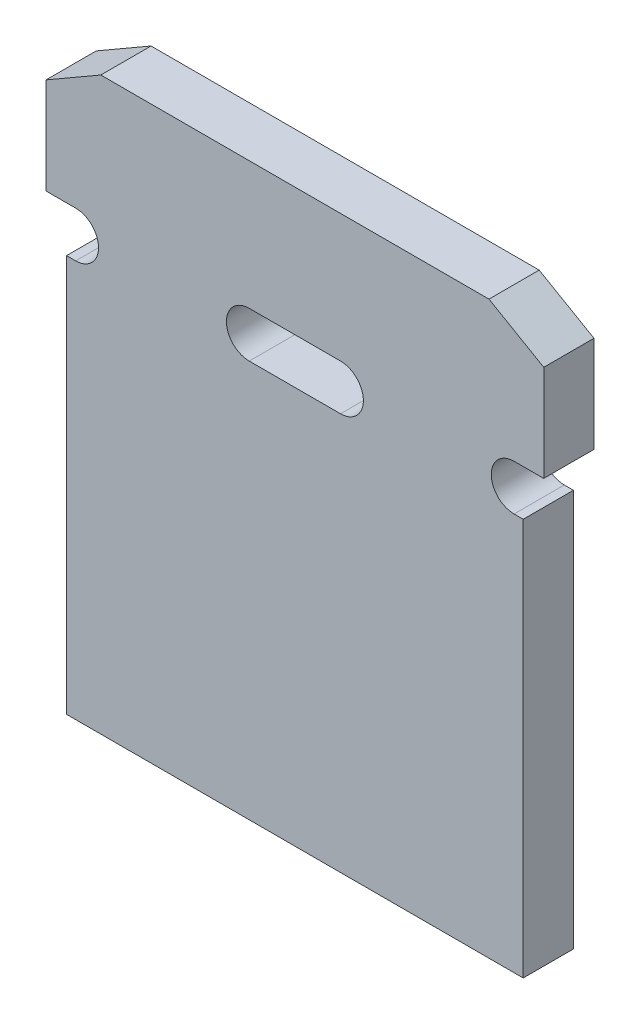
ISO-10303-21;
HEADER;
FILE_DESCRIPTION(('STEP AP214'),'2;1');
FILE_NAME('part.step','',(''),(''),'','','');
FILE_SCHEMA(('AUTOMOTIVE_DESIGN { 1 0 10303 214 1 1 1 1 }'));
ENDSEC;
DATA;
#1=APPLICATION_CONTEXT('core data for automotive mechanical design processes');
#2=APPLICATION_PROTOCOL_DEFINITION('international standard','automotive_design',2000,#1);
#3=PRODUCT_CONTEXT('',#1,'mechanical');
#4=PRODUCT('Part','Part','',(#3));
#5=PRODUCT_RELATED_PRODUCT_CATEGORY('part','',(#4));
#6=PRODUCT_DEFINITION_FORMATION('','',#4);
#7=PRODUCT_DEFINITION_CONTEXT('part definition',#1,'design');
#8=PRODUCT_DEFINITION('design','',#6,#7);
#9=PRODUCT_DEFINITION_SHAPE('','',#8);
#10=(LENGTH_UNIT() NAMED_UNIT(*) SI_UNIT(.MILLI.,.METRE.));
#11=(NAMED_UNIT(*) PLANE_ANGLE_UNIT() SI_UNIT($,.RADIAN.));
#12=(NAMED_UNIT(*) SI_UNIT($,.STERADIAN.) SOLID_ANGLE_UNIT());
#13=UNCERTAINTY_MEASURE_WITH_UNIT(LENGTH_MEASURE(1.E-05),#10,'distance_accuracy_value','');
#14=(GEOMETRIC_REPRESENTATION_CONTEXT(3) GLOBAL_UNCERTAINTY_ASSIGNED_CONTEXT((#13)) GLOBAL_UNIT_ASSIGNED_CONTEXT((#10,
#11,#12)) REPRESENTATION_CONTEXT('',''));
#15=CARTESIAN_POINT('',(0.,0.,0.));
#16=DIRECTION('',(0.,0.,1.));
#17=DIRECTION('',(1.,0.,0.));
#18=AXIS2_PLACEMENT_3D('',#15,#16,#17);
#19=CARTESIAN_POINT('',(0.,0.,0.));
#20=DIRECTION('',(0.,0.,1.));
#21=DIRECTION('',(0.707106781186548,0.707106781186548,0.));
#22=AXIS2_PLACEMENT_3D('',#19,#20,#21);
#23=PLANE('',#22);
#24=CARTESIAN_POINT('',(-0.109999999998502,7.75000000000292,0.));
#25=DIRECTION('',(0.,0.,-1.));
#26=DIRECTION('',(0.,1.,0.));
#27=AXIS2_PLACEMENT_3D('',#24,#25,#26);
#28=CIRCLE('',#27,0.25);
#29=CARTESIAN_POINT('',(-0.109999999998502,8.00000000000292,0.));
#30=VERTEX_POINT('',#29);
#31=CARTESIAN_POINT('',(-0.109999999998502,7.50000000000292,0.));
#32=VERTEX_POINT('',#31);
#33=EDGE_CURVE('E174',#30,#32,#28,.T.);
#34=ORIENTED_EDGE('',*,*,#33,.F.);
#35=DIRECTION('',(1.,0.,0.));
#36=VECTOR('',#35,1.);
#37=CARTESIAN_POINT('',(-0.434999999998499,8.00000000000292,0.));
#38=LINE('',#37,#36);
#39=CARTESIAN_POINT('',(-0.434999999998499,8.00000000000292,0.));
#40=VERTEX_POINT('',#39);
#41=EDGE_CURVE('E35',#40,#30,#38,.T.);
#42=ORIENTED_EDGE('',*,*,#41,.F.);
#43=DIRECTION('',(0.,-1.,0.));
#44=VECTOR('',#43,1.);
#45=CARTESIAN_POINT('',(-0.434999999998499,9.05358983848914,0.));
#46=LINE('',#45,#44);
#47=CARTESIAN_POINT('',(-0.434999999998499,9.05358983848914,0.));
#48=VERTEX_POINT('',#47);
#49=EDGE_CURVE('E177',#48,#40,#46,.T.);
#50=ORIENTED_EDGE('',*,*,#49,.F.);
#51=DIRECTION('',(-0.866025403784437,-0.5,0.));
#52=VECTOR('',#51,1.);
#53=CARTESIAN_POINT('',(0.165000000001502,9.40000000000292,0.));
#54=LINE('',#53,#52);
#55=CARTESIAN_POINT('',(0.165000000001502,9.40000000000292,0.));
#56=VERTEX_POINT('',#55);
#57=EDGE_CURVE('E181',#56,#48,#54,.T.);
#58=ORIENTED_EDGE('',*,*,#57,.F.);
#59=DIRECTION('',(-1.,0.,0.));
#60=VECTOR('',#59,1.);
#61=CARTESIAN_POINT('',(4.4150000000015,9.40000000000292,0.));
#62=LINE('',#61,#60);
#63=CARTESIAN_POINT('',(4.4150000000015,9.40000000000292,0.));
#64=VERTEX_POINT('',#63);
#65=EDGE_CURVE('E185',#64,#56,#62,.T.);
#66=ORIENTED_EDGE('',*,*,#65,.F.);
#67=DIRECTION('',(-0.866025403784437,0.5,0.));
#68=VECTOR('',#67,1.);
#69=CARTESIAN_POINT('',(5.0150000000015,9.05358983848914,0.));
#70=LINE('',#69,#68);
#71=CARTESIAN_POINT('',(5.0150000000015,9.05358983848914,0.));
#72=VERTEX_POINT('',#71);
#73=EDGE_CURVE('E189',#72,#64,#70,.T.);
#74=ORIENTED_EDGE('',*,*,#73,.F.);
#75=DIRECTION('',(0.,1.,0.));
#76=VECTOR('',#75,1.);
#77=CARTESIAN_POINT('',(5.0150000000015,8.00000000000292,0.));
#78=LINE('',#77,#76);
#79=CARTESIAN_POINT('',(5.0150000000015,8.00000000000292,0.));
#80=VERTEX_POINT('',#79);
#81=EDGE_CURVE('E193',#80,#72,#78,.T.);
#82=ORIENTED_EDGE('',*,*,#81,.F.);
#83=DIRECTION('',(1.,0.,0.));
#84=VECTOR('',#83,1.);
#85=CARTESIAN_POINT('',(4.6900000000015,8.00000000000292,0.));
#86=LINE('',#85,#84);
#87=CARTESIAN_POINT('',(4.6900000000015,8.00000000000292,0.));
#88=VERTEX_POINT('',#87);
#89=EDGE_CURVE('E197',#88,#80,#86,.T.);
#90=ORIENTED_EDGE('',*,*,#89,.F.);
#91=CARTESIAN_POINT('',(4.6900000000015,7.75000000000292,0.));
#92=DIRECTION('',(0.,0.,-1.));
#93=DIRECTION('',(0.,-1.,0.));
#94=AXIS2_PLACEMENT_3D('',#91,#92,#93);
#95=CIRCLE('',#94,0.25);
#96=CARTESIAN_POINT('',(4.6900000000015,7.50000000000292,0.));
#97=VERTEX_POINT('',#96);
#98=EDGE_CURVE('E201',#97,#88,#95,.T.);
#99=ORIENTED_EDGE('',*,*,#98,.F.);
#100=DIRECTION('',(-1.,0.,0.));
#101=VECTOR('',#100,1.);
#102=CARTESIAN_POINT('',(4.79000000000131,7.50000000000292,0.));
#103=LINE('',#102,#101);
#104=CARTESIAN_POINT('',(4.79000000000131,7.50000000000292,0.));
#105=VERTEX_POINT('',#104);
#106=EDGE_CURVE('E205',#105,#97,#103,.T.);
#107=ORIENTED_EDGE('',*,*,#106,.F.);
#108=DIRECTION('',(0.,1.,0.));
#109=VECTOR('',#108,1.);
#110=CARTESIAN_POINT('',(4.79000000000131,3.15000000000292,0.));
#111=LINE('',#110,#109);
#112=CARTESIAN_POINT('',(4.79000000000131,3.15000000000292,0.));
#113=VERTEX_POINT('',#112);
#114=EDGE_CURVE('E209',#113,#105,#111,.T.);
#115=ORIENTED_EDGE('',*,*,#114,.F.);
#116=DIRECTION('',(1.,0.,0.));
#117=VECTOR('',#116,1.);
#118=CARTESIAN_POINT('',(-0.209999999998307,3.15000000000292,0.));
#119=LINE('',#118,#117);
#120=CARTESIAN_POINT('',(-0.209999999998307,3.15000000000292,0.));
#121=VERTEX_POINT('',#120);
#122=EDGE_CURVE('E213',#121,#113,#119,.T.);
#123=ORIENTED_EDGE('',*,*,#122,.F.);
#124=DIRECTION('',(0.,-1.,0.));
#125=VECTOR('',#124,1.);
#126=CARTESIAN_POINT('',(-0.209999999998306,7.50000000000292,0.));
#127=LINE('',#126,#125);
#128=CARTESIAN_POINT('',(-0.209999999998306,7.50000000000292,0.));
#129=VERTEX_POINT('',#128);
#130=EDGE_CURVE('E216',#129,#121,#127,.T.);
#131=ORIENTED_EDGE('',*,*,#130,.F.);
#132=DIRECTION('',(-1.,0.,0.));
#133=VECTOR('',#132,1.);
#134=CARTESIAN_POINT('',(-0.109999999998502,7.50000000000292,0.));
#135=LINE('',#134,#133);
#136=EDGE_CURVE('E219',#32,#129,#135,.T.);
#137=ORIENTED_EDGE('',*,*,#136,.F.);
#138=EDGE_LOOP('',(#34,#42,#50,#58,#66,#74,#82,#90,#99,#107,#115,#123,#131,#137));
#139=FACE_BOUND('',#138,.T.);
#140=DIRECTION('',(1.,0.,0.));
#141=VECTOR('',#140,1.);
#142=CARTESIAN_POINT('',(1.7900000000015,7.50000000000292,0.));
#143=LINE('',#142,#141);
#144=CARTESIAN_POINT('',(1.7900000000015,7.50000000000292,0.));
#145=VERTEX_POINT('',#144);
#146=CARTESIAN_POINT('',(2.7900000000015,7.50000000000292,0.));
#147=VERTEX_POINT('',#146);
#148=EDGE_CURVE('E11',#145,#147,#143,.T.);
#149=ORIENTED_EDGE('',*,*,#148,.T.);
#150=CARTESIAN_POINT('',(2.7900000000015,7.75000000000292,0.));
#151=DIRECTION('',(0.,0.,1.));
#152=DIRECTION('',(0.,-1.,0.));
#153=AXIS2_PLACEMENT_3D('',#150,#151,#152);
#154=CIRCLE('',#153,0.25);
#155=CARTESIAN_POINT('',(2.7900000000015,8.00000000000292,0.));
#156=VERTEX_POINT('',#155);
#157=EDGE_CURVE('E26',#147,#156,#154,.T.);
#158=ORIENTED_EDGE('',*,*,#157,.T.);
#159=DIRECTION('',(-1.,0.,0.));
#160=VECTOR('',#159,1.);
#161=CARTESIAN_POINT('',(2.7900000000015,8.00000000000292,0.));
#162=LINE('',#161,#160);
#163=CARTESIAN_POINT('',(1.7900000000015,8.00000000000292,0.));
#164=VERTEX_POINT('',#163);
#165=EDGE_CURVE('E163',#156,#164,#162,.T.);
#166=ORIENTED_EDGE('',*,*,#165,.T.);
#167=CARTESIAN_POINT('',(1.7900000000015,7.75000000000292,0.));
#168=DIRECTION('',(0.,0.,1.));
#169=DIRECTION('',(0.,1.,0.));
#170=AXIS2_PLACEMENT_3D('',#167,#168,#169);
#171=CIRCLE('',#170,0.25);
#172=EDGE_CURVE('E232',#164,#145,#171,.T.);
#173=ORIENTED_EDGE('',*,*,#172,.T.);
#174=EDGE_LOOP('',(#149,#158,#166,#173));
#175=FACE_BOUND('',#174,.T.);
#176=ADVANCED_FACE('F16',(#139,#175),#23,.F.);
#177=CARTESIAN_POINT('',(0.,0.,0.55));
#178=DIRECTION('',(0.,0.,1.));
#179=DIRECTION('',(0.707106781186548,0.707106781186548,0.));
#180=AXIS2_PLACEMENT_3D('',#177,#178,#179);
#181=PLANE('',#180);
#182=DIRECTION('',(-1.,0.,0.));
#183=VECTOR('',#182,1.);
#184=CARTESIAN_POINT('',(-0.109999999998502,7.50000000000292,0.55));
#185=LINE('',#184,#183);
#186=CARTESIAN_POINT('',(-0.109999999998502,7.50000000000292,0.55));
#187=VERTEX_POINT('',#186);
#188=CARTESIAN_POINT('',(-0.209999999998306,7.50000000000292,0.55));
#189=VERTEX_POINT('',#188);
#190=EDGE_CURVE('E234',#187,#189,#185,.T.);
#191=ORIENTED_EDGE('',*,*,#190,.T.);
#192=DIRECTION('',(0.,-1.,0.));
#193=VECTOR('',#192,1.);
#194=CARTESIAN_POINT('',(-0.209999999998306,7.50000000000292,0.55));
#195=LINE('',#194,#193);
#196=CARTESIAN_POINT('',(-0.209999999998307,3.15000000000292,0.55));
#197=VERTEX_POINT('',#196);
#198=EDGE_CURVE('E237',#189,#197,#195,.T.);
#199=ORIENTED_EDGE('',*,*,#198,.T.);
#200=DIRECTION('',(1.,0.,0.));
#201=VECTOR('',#200,1.);
#202=CARTESIAN_POINT('',(-0.209999999998307,3.15000000000292,0.55));
#203=LINE('',#202,#201);
#204=CARTESIAN_POINT('',(4.79000000000131,3.15000000000292,0.55));
#205=VERTEX_POINT('',#204);
#206=EDGE_CURVE('E240',#197,#205,#203,.T.);
#207=ORIENTED_EDGE('',*,*,#206,.T.);
#208=DIRECTION('',(0.,1.,0.));
#209=VECTOR('',#208,1.);
#210=CARTESIAN_POINT('',(4.79000000000131,3.15000000000292,0.55));
#211=LINE('',#210,#209);
#212=CARTESIAN_POINT('',(4.79000000000131,7.50000000000292,0.55));
#213=VERTEX_POINT('',#212);
#214=EDGE_CURVE('E243',#205,#213,#211,.T.);
#215=ORIENTED_EDGE('',*,*,#214,.T.);
#216=DIRECTION('',(-1.,0.,0.));
#217=VECTOR('',#216,1.);
#218=CARTESIAN_POINT('',(4.79000000000131,7.50000000000292,0.55));
#219=LINE('',#218,#217);
#220=CARTESIAN_POINT('',(4.6900000000015,7.50000000000292,0.55));
#221=VERTEX_POINT('',#220);
#222=EDGE_CURVE('E246',#213,#221,#219,.T.);
#223=ORIENTED_EDGE('',*,*,#222,.T.);
#224=CARTESIAN_POINT('',(4.6900000000015,7.75000000000292,0.55));
#225=DIRECTION('',(0.,0.,-1.));
#226=DIRECTION('',(0.,-1.,0.));
#227=AXIS2_PLACEMENT_3D('',#224,#225,#226);
#228=CIRCLE('',#227,0.25);
#229=CARTESIAN_POINT('',(4.6900000000015,8.00000000000292,0.55));
#230=VERTEX_POINT('',#229);
#231=EDGE_CURVE('E249',#221,#230,#228,.T.);
#232=ORIENTED_EDGE('',*,*,#231,.T.);
#233=DIRECTION('',(1.,0.,0.));
#234=VECTOR('',#233,1.);
#235=CARTESIAN_POINT('',(4.6900000000015,8.00000000000292,0.55));
#236=LINE('',#235,#234);
#237=CARTESIAN_POINT('',(5.0150000000015,8.00000000000292,0.55));
#238=VERTEX_POINT('',#237);
#239=EDGE_CURVE('E252',#230,#238,#236,.T.);
#240=ORIENTED_EDGE('',*,*,#239,.T.);
#241=DIRECTION('',(0.,1.,0.));
#242=VECTOR('',#241,1.);
#243=CARTESIAN_POINT('',(5.0150000000015,8.00000000000292,0.55));
#244=LINE('',#243,#242);
#245=CARTESIAN_POINT('',(5.0150000000015,9.05358983848914,0.55));
#246=VERTEX_POINT('',#245);
#247=EDGE_CURVE('E255',#238,#246,#244,.T.);
#248=ORIENTED_EDGE('',*,*,#247,.T.);
#249=DIRECTION('',(-0.866025403784437,0.5,0.));
#250=VECTOR('',#249,1.);
#251=CARTESIAN_POINT('',(5.0150000000015,9.05358983848914,0.55));
#252=LINE('',#251,#250);
#253=CARTESIAN_POINT('',(4.4150000000015,9.40000000000292,0.55));
#254=VERTEX_POINT('',#253);
#255=EDGE_CURVE('E258',#246,#254,#252,.T.);
#256=ORIENTED_EDGE('',*,*,#255,.T.);
#257=DIRECTION('',(-1.,0.,0.));
#258=VECTOR('',#257,1.);
#259=CARTESIAN_POINT('',(4.4150000000015,9.40000000000292,0.55));
#260=LINE('',#259,#258);
#261=CARTESIAN_POINT('',(0.165000000001502,9.40000000000292,0.55));
#262=VERTEX_POINT('',#261);
#263=EDGE_CURVE('E261',#254,#262,#260,.T.);
#264=ORIENTED_EDGE('',*,*,#263,.T.);
#265=DIRECTION('',(-0.866025403784437,-0.5,0.));
#266=VECTOR('',#265,1.);
#267=CARTESIAN_POINT('',(0.165000000001502,9.40000000000292,0.55));
#268=LINE('',#267,#266);
#269=CARTESIAN_POINT('',(-0.434999999998499,9.05358983848914,0.55));
#270=VERTEX_POINT('',#269);
#271=EDGE_CURVE('E264',#262,#270,#268,.T.);
#272=ORIENTED_EDGE('',*,*,#271,.T.);
#273=DIRECTION('',(0.,-1.,0.));
#274=VECTOR('',#273,1.);
#275=CARTESIAN_POINT('',(-0.434999999998499,9.05358983848914,0.55));
#276=LINE('',#275,#274);
#277=CARTESIAN_POINT('',(-0.434999999998499,8.00000000000292,0.55));
#278=VERTEX_POINT('',#277);
#279=EDGE_CURVE('E267',#270,#278,#276,.T.);
#280=ORIENTED_EDGE('',*,*,#279,.T.);
#281=DIRECTION('',(1.,0.,0.));
#282=VECTOR('',#281,1.);
#283=CARTESIAN_POINT('',(-0.434999999998499,8.00000000000292,0.55));
#284=LINE('',#283,#282);
#285=CARTESIAN_POINT('',(-0.109999999998502,8.00000000000292,0.55));
#286=VERTEX_POINT('',#285);
#287=EDGE_CURVE('E270',#278,#286,#284,.T.);
#288=ORIENTED_EDGE('',*,*,#287,.T.);
#289=CARTESIAN_POINT('',(-0.109999999998502,7.75000000000292,0.55));
#290=DIRECTION('',(0.,0.,-1.));
#291=DIRECTION('',(0.,1.,0.));
#292=AXIS2_PLACEMENT_3D('',#289,#290,#291);
#293=CIRCLE('',#292,0.25);
#294=EDGE_CURVE('E273',#286,#187,#293,.T.);
#295=ORIENTED_EDGE('',*,*,#294,.T.);
#296=EDGE_LOOP('',(#191,#199,#207,#215,#223,#232,#240,#248,#256,#264,#272,#280,#288,#295));
#297=FACE_BOUND('',#296,.T.);
#298=DIRECTION('',(-1.,0.,0.));
#299=VECTOR('',#298,1.);
#300=CARTESIAN_POINT('',(1.7900000000015,7.50000000000292,0.55));
#301=LINE('',#300,#299);
#302=CARTESIAN_POINT('',(2.7900000000015,7.50000000000292,0.55));
#303=VERTEX_POINT('',#302);
#304=CARTESIAN_POINT('',(1.7900000000015,7.50000000000292,0.55));
#305=VERTEX_POINT('',#304);
#306=EDGE_CURVE('E275',#303,#305,#301,.T.);
#307=ORIENTED_EDGE('',*,*,#306,.T.);
#308=CARTESIAN_POINT('',(1.7900000000015,7.75000000000292,0.55));
#309=DIRECTION('',(0.,0.,-1.));
#310=DIRECTION('',(0.,1.,0.));
#311=AXIS2_PLACEMENT_3D('',#308,#309,#310);
#312=CIRCLE('',#311,0.25);
#313=CARTESIAN_POINT('',(1.7900000000015,8.00000000000292,0.55));
#314=VERTEX_POINT('',#313);
#315=EDGE_CURVE('E158',#305,#314,#312,.T.);
#316=ORIENTED_EDGE('',*,*,#315,.T.);
#317=DIRECTION('',(1.,0.,0.));
#318=VECTOR('',#317,1.);
#319=CARTESIAN_POINT('',(2.7900000000015,8.00000000000292,0.55));
#320=LINE('',#319,#318);
#321=CARTESIAN_POINT('',(2.7900000000015,8.00000000000292,0.55));
#322=VERTEX_POINT('',#321);
#323=EDGE_CURVE('E141',#314,#322,#320,.T.);
#324=ORIENTED_EDGE('',*,*,#323,.T.);
#325=CARTESIAN_POINT('',(2.7900000000015,7.75000000000292,0.55));
#326=DIRECTION('',(0.,0.,-1.));
#327=DIRECTION('',(0.,-1.,0.));
#328=AXIS2_PLACEMENT_3D('',#325,#326,#327);
#329=CIRCLE('',#328,0.25);
#330=EDGE_CURVE('E147',#322,#303,#329,.T.);
#331=ORIENTED_EDGE('',*,*,#330,.T.);
#332=EDGE_LOOP('',(#307,#316,#324,#331));
#333=FACE_BOUND('',#332,.T.);
#334=ADVANCED_FACE('F157',(#297,#333),#181,.T.);
#335=CARTESIAN_POINT('',(1.7900000000015,7.75000000000292,0.));
#336=DIRECTION('',(0.,0.,1.));
#337=DIRECTION('',(0.,1.,0.));
#338=AXIS2_PLACEMENT_3D('',#335,#336,#337);
#339=CYLINDRICAL_SURFACE('',#338,0.25);
#340=ORIENTED_EDGE('',*,*,#315,.F.);
#341=DIRECTION('',(0.,0.,1.));
#342=VECTOR('',#341,1.);
#343=CARTESIAN_POINT('',(1.7900000000015,7.50000000000292,0.));
#344=LINE('',#343,#342);
#345=EDGE_CURVE('E167',#145,#305,#344,.T.);
#346=ORIENTED_EDGE('',*,*,#345,.F.);
#347=ORIENTED_EDGE('',*,*,#172,.F.);
#348=DIRECTION('',(0.,0.,1.));
#349=VECTOR('',#348,1.);
#350=CARTESIAN_POINT('',(1.7900000000015,8.00000000000292,0.));
#351=LINE('',#350,#349);
#352=EDGE_CURVE('E155',#164,#314,#351,.T.);
#353=ORIENTED_EDGE('',*,*,#352,.T.);
#354=EDGE_LOOP('',(#340,#346,#347,#353));
#355=FACE_BOUND('',#354,.T.);
#356=ADVANCED_FACE('F331',(#355),#339,.F.);
#357=CARTESIAN_POINT('',(2.7900000000015,8.00000000000292,0.));
#358=DIRECTION('',(0.,1.,0.));
#359=DIRECTION('',(0.707106781186548,0.,0.707106781186548));
#360=AXIS2_PLACEMENT_3D('',#357,#358,#359);
#361=PLANE('',#360);
#362=ORIENTED_EDGE('',*,*,#323,.F.);
#363=ORIENTED_EDGE('',*,*,#352,.F.);
#364=ORIENTED_EDGE('',*,*,#165,.F.);
#365=DIRECTION('',(0.,0.,1.));
#366=VECTOR('',#365,1.);
#367=CARTESIAN_POINT('',(2.7900000000015,8.00000000000292,0.));
#368=LINE('',#367,#366);
#369=EDGE_CURVE('E149',#156,#322,#368,.T.);
#370=ORIENTED_EDGE('',*,*,#369,.T.);
#371=EDGE_LOOP('',(#362,#363,#364,#370));
#372=FACE_BOUND('',#371,.T.);
#373=ADVANCED_FACE('F161',(#372),#361,.F.);
#374=CARTESIAN_POINT('',(2.7900000000015,7.75000000000292,0.));
#375=DIRECTION('',(0.,0.,1.));
#376=DIRECTION('',(0.,-1.,0.));
#377=AXIS2_PLACEMENT_3D('',#374,#375,#376);
#378=CYLINDRICAL_SURFACE('',#377,0.25);
#379=ORIENTED_EDGE('',*,*,#330,.F.);
#380=ORIENTED_EDGE('',*,*,#369,.F.);
#381=ORIENTED_EDGE('',*,*,#157,.F.);
#382=DIRECTION('',(0.,0.,1.));
#383=VECTOR('',#382,1.);
#384=CARTESIAN_POINT('',(2.7900000000015,7.50000000000292,0.));
#385=LINE('',#384,#383);
#386=EDGE_CURVE('E151',#147,#303,#385,.T.);
#387=ORIENTED_EDGE('',*,*,#386,.T.);
#388=EDGE_LOOP('',(#379,#380,#381,#387));
#389=FACE_BOUND('',#388,.T.);
#390=ADVANCED_FACE('F148',(#389),#378,.F.);
#391=CARTESIAN_POINT('',(1.7900000000015,7.50000000000292,0.));
#392=DIRECTION('',(0.,-1.,0.));
#393=DIRECTION('',(0.707106781186548,0.,0.707106781186548));
#394=AXIS2_PLACEMENT_3D('',#391,#392,#393);
#395=PLANE('',#394);
#396=ORIENTED_EDGE('',*,*,#306,.F.);
#397=ORIENTED_EDGE('',*,*,#386,.F.);
#398=ORIENTED_EDGE('',*,*,#148,.F.);
#399=ORIENTED_EDGE('',*,*,#345,.T.);
#400=EDGE_LOOP('',(#396,#397,#398,#399));
#401=FACE_BOUND('',#400,.T.);
#402=ADVANCED_FACE('F324',(#401),#395,.F.);
#403=CARTESIAN_POINT('',(-0.109999999998502,7.75000000000292,0.));
#404=DIRECTION('',(0.,0.,-1.));
#405=DIRECTION('',(0.,1.,0.));
#406=AXIS2_PLACEMENT_3D('',#403,#404,#405);
#407=CYLINDRICAL_SURFACE('',#406,0.25);
#408=ORIENTED_EDGE('',*,*,#33,.T.);
#409=DIRECTION('',(0.,0.,1.));
#410=VECTOR('',#409,1.);
#411=CARTESIAN_POINT('',(-0.109999999998502,7.50000000000292,0.));
#412=LINE('',#411,#410);
#413=EDGE_CURVE('E171',#32,#187,#412,.T.);
#414=ORIENTED_EDGE('',*,*,#413,.T.);
#415=ORIENTED_EDGE('',*,*,#294,.F.);
#416=DIRECTION('',(0.,0.,1.));
#417=VECTOR('',#416,1.);
#418=CARTESIAN_POINT('',(-0.109999999998502,8.00000000000292,0.));
#419=LINE('',#418,#417);
#420=EDGE_CURVE('E175',#30,#286,#419,.T.);
#421=ORIENTED_EDGE('',*,*,#420,.F.);
#422=EDGE_LOOP('',(#408,#414,#415,#421));
#423=FACE_BOUND('',#422,.T.);
#424=ADVANCED_FACE('F311',(#423),#407,.F.);
#425=CARTESIAN_POINT('',(-0.434999999998499,8.00000000000292,0.));
#426=DIRECTION('',(0.,-1.,0.));
#427=DIRECTION('',(0.707106781186548,0.,0.707106781186548));
#428=AXIS2_PLACEMENT_3D('',#425,#426,#427);
#429=PLANE('',#428);
#430=ORIENTED_EDGE('',*,*,#41,.T.);
#431=ORIENTED_EDGE('',*,*,#420,.T.);
#432=ORIENTED_EDGE('',*,*,#287,.F.);
#433=DIRECTION('',(0.,0.,1.));
#434=VECTOR('',#433,1.);
#435=CARTESIAN_POINT('',(-0.434999999998499,8.00000000000292,0.));
#436=LINE('',#435,#434);
#437=EDGE_CURVE('E178',#40,#278,#436,.T.);
#438=ORIENTED_EDGE('',*,*,#437,.F.);
#439=EDGE_LOOP('',(#430,#431,#432,#438));
#440=FACE_BOUND('',#439,.T.);
#441=ADVANCED_FACE('F312',(#440),#429,.T.);
#442=CARTESIAN_POINT('',(-0.434999999998499,9.05358983848914,0.));
#443=DIRECTION('',(-1.,0.,0.));
#444=DIRECTION('',(0.,0.707106781186548,0.707106781186548));
#445=AXIS2_PLACEMENT_3D('',#442,#443,#444);
#446=PLANE('',#445);
#447=ORIENTED_EDGE('',*,*,#49,.T.);
#448=ORIENTED_EDGE('',*,*,#437,.T.);
#449=ORIENTED_EDGE('',*,*,#279,.F.);
#450=DIRECTION('',(0.,0.,1.));
#451=VECTOR('',#450,1.);
#452=CARTESIAN_POINT('',(-0.434999999998499,9.05358983848914,0.));
#453=LINE('',#452,#451);
#454=EDGE_CURVE('E182',#48,#270,#453,.T.);
#455=ORIENTED_EDGE('',*,*,#454,.F.);
#456=EDGE_LOOP('',(#447,#448,#449,#455));
#457=FACE_BOUND('',#456,.T.);
#458=ADVANCED_FACE('F314',(#457),#446,.T.);
#459=CARTESIAN_POINT('',(0.165000000001502,9.40000000000292,0.));
#460=DIRECTION('',(-0.5,0.866025403784437,0.));
#461=DIRECTION('',(0.774596669241481,0.44721359549996,0.44721359549996));
#462=AXIS2_PLACEMENT_3D('',#459,#460,#461);
#463=PLANE('',#462);
#464=ORIENTED_EDGE('',*,*,#57,.T.);
#465=ORIENTED_EDGE('',*,*,#454,.T.);
#466=ORIENTED_EDGE('',*,*,#271,.F.);
#467=DIRECTION('',(0.,0.,1.));
#468=VECTOR('',#467,1.);
#469=CARTESIAN_POINT('',(0.165000000001502,9.40000000000292,0.));
#470=LINE('',#469,#468);
#471=EDGE_CURVE('E186',#56,#262,#470,.T.);
#472=ORIENTED_EDGE('',*,*,#471,.F.);
#473=EDGE_LOOP('',(#464,#465,#466,#472));
#474=FACE_BOUND('',#473,.T.);
#475=ADVANCED_FACE('F321',(#474),#463,.T.);
#476=CARTESIAN_POINT('',(4.4150000000015,9.40000000000292,0.));
#477=DIRECTION('',(0.,1.,0.));
#478=DIRECTION('',(0.707106781186548,0.,0.707106781186548));
#479=AXIS2_PLACEMENT_3D('',#476,#477,#478);
#480=PLANE('',#479);
#481=ORIENTED_EDGE('',*,*,#65,.T.);
#482=ORIENTED_EDGE('',*,*,#471,.T.);
#483=ORIENTED_EDGE('',*,*,#263,.F.);
#484=DIRECTION('',(0.,0.,1.));
#485=VECTOR('',#484,1.);
#486=CARTESIAN_POINT('',(4.4150000000015,9.40000000000292,0.));
#487=LINE('',#486,#485);
#488=EDGE_CURVE('E190',#64,#254,#487,.T.);
#489=ORIENTED_EDGE('',*,*,#488,.F.);
#490=EDGE_LOOP('',(#481,#482,#483,#489));
#491=FACE_BOUND('',#490,.T.);
#492=ADVANCED_FACE('F380',(#491),#480,.T.);
#493=CARTESIAN_POINT('',(5.0150000000015,9.05358983848914,0.));
#494=DIRECTION('',(0.5,0.866025403784437,0.));
#495=DIRECTION('',(-0.774596669241481,0.44721359549996,0.44721359549996));
#496=AXIS2_PLACEMENT_3D('',#493,#494,#495);
#497=PLANE('',#496);
#498=ORIENTED_EDGE('',*,*,#73,.T.);
#499=ORIENTED_EDGE('',*,*,#488,.T.);
#500=ORIENTED_EDGE('',*,*,#255,.F.);
#501=DIRECTION('',(0.,0.,1.));
#502=VECTOR('',#501,1.);
#503=CARTESIAN_POINT('',(5.0150000000015,9.05358983848914,0.));
#504=LINE('',#503,#502);
#505=EDGE_CURVE('E194',#72,#246,#504,.T.);
#506=ORIENTED_EDGE('',*,*,#505,.F.);
#507=EDGE_LOOP('',(#498,#499,#500,#506));
#508=FACE_BOUND('',#507,.T.);
#509=ADVANCED_FACE('F391',(#508),#497,.T.);
#510=CARTESIAN_POINT('',(5.0150000000015,8.00000000000292,0.));
#511=DIRECTION('',(1.,0.,0.));
#512=DIRECTION('',(0.,0.707106781186548,0.707106781186548));
#513=AXIS2_PLACEMENT_3D('',#510,#511,#512);
#514=PLANE('',#513);
#515=ORIENTED_EDGE('',*,*,#81,.T.);
#516=ORIENTED_EDGE('',*,*,#505,.T.);
#517=ORIENTED_EDGE('',*,*,#247,.F.);
#518=DIRECTION('',(0.,0.,1.));
#519=VECTOR('',#518,1.);
#520=CARTESIAN_POINT('',(5.0150000000015,8.00000000000292,0.));
#521=LINE('',#520,#519);
#522=EDGE_CURVE('E198',#80,#238,#521,.T.);
#523=ORIENTED_EDGE('',*,*,#522,.F.);
#524=EDGE_LOOP('',(#515,#516,#517,#523));
#525=FACE_BOUND('',#524,.T.);
#526=ADVANCED_FACE('F402',(#525),#514,.T.);
#527=CARTESIAN_POINT('',(4.6900000000015,8.00000000000292,0.));
#528=DIRECTION('',(0.,-1.,0.));
#529=DIRECTION('',(0.707106781186548,0.,0.707106781186548));
#530=AXIS2_PLACEMENT_3D('',#527,#528,#529);
#531=PLANE('',#530);
#532=ORIENTED_EDGE('',*,*,#89,.T.);
#533=ORIENTED_EDGE('',*,*,#522,.T.);
#534=ORIENTED_EDGE('',*,*,#239,.F.);
#535=DIRECTION('',(0.,0.,1.));
#536=VECTOR('',#535,1.);
#537=CARTESIAN_POINT('',(4.6900000000015,8.00000000000292,0.));
#538=LINE('',#537,#536);
#539=EDGE_CURVE('E202',#88,#230,#538,.T.);
#540=ORIENTED_EDGE('',*,*,#539,.F.);
#541=EDGE_LOOP('',(#532,#533,#534,#540));
#542=FACE_BOUND('',#541,.T.);
#543=ADVANCED_FACE('F413',(#542),#531,.T.);
#544=CARTESIAN_POINT('',(4.6900000000015,7.75000000000292,0.));
#545=DIRECTION('',(0.,0.,-1.));
#546=DIRECTION('',(0.,-1.,0.));
#547=AXIS2_PLACEMENT_3D('',#544,#545,#546);
#548=CYLINDRICAL_SURFACE('',#547,0.25);
#549=ORIENTED_EDGE('',*,*,#98,.T.);
#550=ORIENTED_EDGE('',*,*,#539,.T.);
#551=ORIENTED_EDGE('',*,*,#231,.F.);
#552=DIRECTION('',(0.,0.,1.));
#553=VECTOR('',#552,1.);
#554=CARTESIAN_POINT('',(4.6900000000015,7.50000000000292,0.));
#555=LINE('',#554,#553);
#556=EDGE_CURVE('E206',#97,#221,#555,.T.);
#557=ORIENTED_EDGE('',*,*,#556,.F.);
#558=EDGE_LOOP('',(#549,#550,#551,#557));
#559=FACE_BOUND('',#558,.T.);
#560=ADVANCED_FACE('F424',(#559),#548,.F.);
#561=CARTESIAN_POINT('',(4.79000000000131,7.50000000000292,0.));
#562=DIRECTION('',(0.,1.,0.));
#563=DIRECTION('',(0.707106781186548,0.,0.707106781186548));
#564=AXIS2_PLACEMENT_3D('',#561,#562,#563);
#565=PLANE('',#564);
#566=ORIENTED_EDGE('',*,*,#106,.T.);
#567=ORIENTED_EDGE('',*,*,#556,.T.);
#568=ORIENTED_EDGE('',*,*,#222,.F.);
#569=DIRECTION('',(0.,0.,1.));
#570=VECTOR('',#569,1.);
#571=CARTESIAN_POINT('',(4.79000000000131,7.50000000000292,0.));
#572=LINE('',#571,#570);
#573=EDGE_CURVE('E210',#105,#213,#572,.T.);
#574=ORIENTED_EDGE('',*,*,#573,.F.);
#575=EDGE_LOOP('',(#566,#567,#568,#574));
#576=FACE_BOUND('',#575,.T.);
#577=ADVANCED_FACE('F435',(#576),#565,.T.);
#578=CARTESIAN_POINT('',(4.79000000000131,3.15000000000292,0.));
#579=DIRECTION('',(1.,0.,0.));
#580=DIRECTION('',(0.,0.707106781186548,0.707106781186548));
#581=AXIS2_PLACEMENT_3D('',#578,#579,#580);
#582=PLANE('',#581);
#583=ORIENTED_EDGE('',*,*,#114,.T.);
#584=ORIENTED_EDGE('',*,*,#573,.T.);
#585=ORIENTED_EDGE('',*,*,#214,.F.);
#586=DIRECTION('',(0.,0.,1.));
#587=VECTOR('',#586,1.);
#588=CARTESIAN_POINT('',(4.79000000000131,3.15000000000292,0.));
#589=LINE('',#588,#587);
#590=EDGE_CURVE('E214',#113,#205,#589,.T.);
#591=ORIENTED_EDGE('',*,*,#590,.F.);
#592=EDGE_LOOP('',(#583,#584,#585,#591));
#593=FACE_BOUND('',#592,.T.);
#594=ADVANCED_FACE('F306',(#593),#582,.T.);
#595=CARTESIAN_POINT('',(-0.209999999998307,3.15000000000292,0.));
#596=DIRECTION('',(0.,-1.,0.));
#597=DIRECTION('',(0.707106781186548,0.,0.707106781186548));
#598=AXIS2_PLACEMENT_3D('',#595,#596,#597);
#599=PLANE('',#598);
#600=ORIENTED_EDGE('',*,*,#122,.T.);
#601=ORIENTED_EDGE('',*,*,#590,.T.);
#602=ORIENTED_EDGE('',*,*,#206,.F.);
#603=DIRECTION('',(0.,0.,1.));
#604=VECTOR('',#603,1.);
#605=CARTESIAN_POINT('',(-0.209999999998307,3.15000000000292,0.));
#606=LINE('',#605,#604);
#607=EDGE_CURVE('E217',#121,#197,#606,.T.);
#608=ORIENTED_EDGE('',*,*,#607,.F.);
#609=EDGE_LOOP('',(#600,#601,#602,#608));
#610=FACE_BOUND('',#609,.T.);
#611=ADVANCED_FACE('F298',(#610),#599,.T.);
#612=CARTESIAN_POINT('',(-0.209999999998306,7.50000000000292,0.));
#613=DIRECTION('',(-1.,0.,0.));
#614=DIRECTION('',(0.,0.707106781186548,0.707106781186548));
#615=AXIS2_PLACEMENT_3D('',#612,#613,#614);
#616=PLANE('',#615);
#617=ORIENTED_EDGE('',*,*,#130,.T.);
#618=ORIENTED_EDGE('',*,*,#607,.T.);
#619=ORIENTED_EDGE('',*,*,#198,.F.);
#620=DIRECTION('',(0.,0.,1.));
#621=VECTOR('',#620,1.);
#622=CARTESIAN_POINT('',(-0.209999999998307,7.50000000000292,0.));
#623=LINE('',#622,#621);
#624=EDGE_CURVE('E20',#129,#189,#623,.T.);
#625=ORIENTED_EDGE('',*,*,#624,.F.);
#626=EDGE_LOOP('',(#617,#618,#619,#625));
#627=FACE_BOUND('',#626,.T.);
#628=ADVANCED_FACE('F310',(#627),#616,.T.);
#629=CARTESIAN_POINT('',(-0.109999999998502,7.50000000000292,0.));
#630=DIRECTION('',(0.,1.,0.));
#631=DIRECTION('',(0.707106781186548,0.,0.707106781186548));
#632=AXIS2_PLACEMENT_3D('',#629,#630,#631);
#633=PLANE('',#632);
#634=ORIENTED_EDGE('',*,*,#136,.T.);
#635=ORIENTED_EDGE('',*,*,#624,.T.);
#636=ORIENTED_EDGE('',*,*,#190,.F.);
#637=ORIENTED_EDGE('',*,*,#413,.F.);
#638=EDGE_LOOP('',(#634,#635,#636,#637));
#639=FACE_BOUND('',#638,.T.);
#640=ADVANCED_FACE('F18',(#639),#633,.T.);
#641=CLOSED_SHELL('',(#176,#334,#356,#373,#390,#402,#424,#441,#458,#475,#492,#509,#526,#543,
#560,#577,#594,#611,#628,#640));
#642=MANIFOLD_SOLID_BREP('B1',#641);
#643=ADVANCED_BREP_SHAPE_REPRESENTATION('',(#18,#642),#14);
#644=SHAPE_DEFINITION_REPRESENTATION(#9,#643);
ENDSEC;
END-ISO-10303-21;
